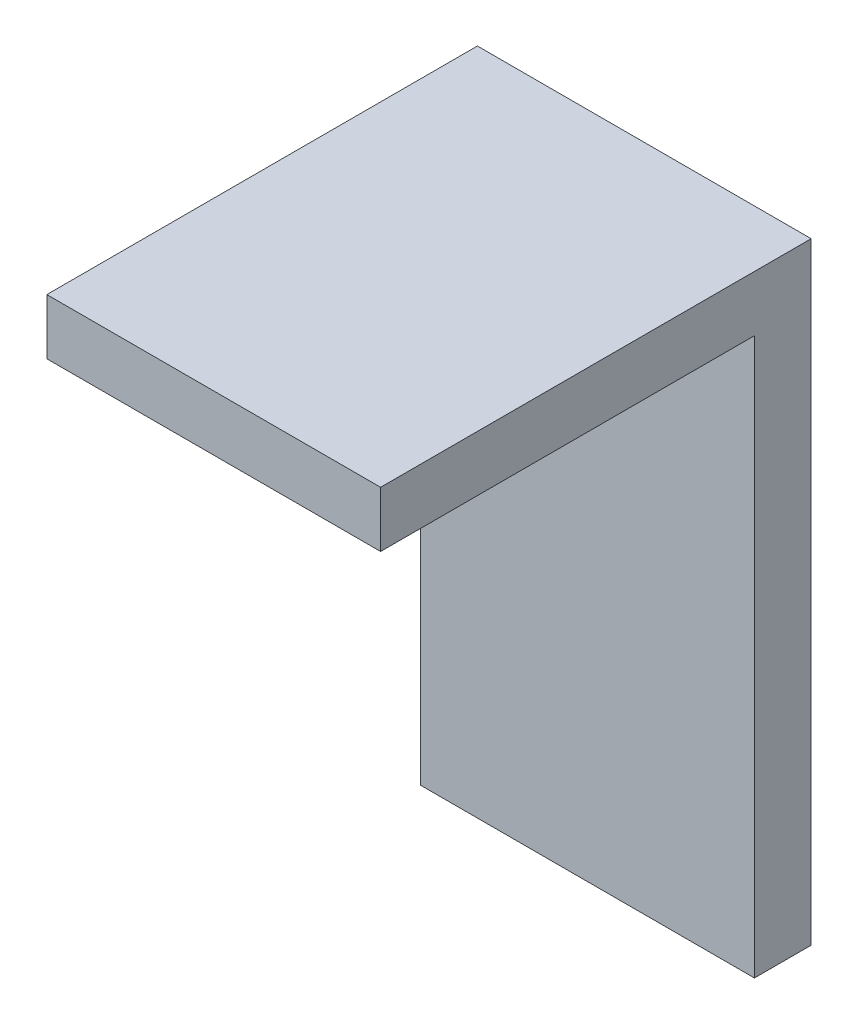
ISO-10303-21;
HEADER;
FILE_DESCRIPTION(('STEP AP214'),'2;1');
FILE_NAME('part.step','',(''),(''),'','','');
FILE_SCHEMA(('AUTOMOTIVE_DESIGN { 1 0 10303 214 1 1 1 1 }'));
ENDSEC;
DATA;
#1=APPLICATION_CONTEXT('core data for automotive mechanical design processes');
#2=APPLICATION_PROTOCOL_DEFINITION('international standard','automotive_design',2000,#1);
#3=PRODUCT_CONTEXT('',#1,'mechanical');
#4=PRODUCT('Part','Part','',(#3));
#5=PRODUCT_RELATED_PRODUCT_CATEGORY('part','',(#4));
#6=PRODUCT_DEFINITION_FORMATION('','',#4);
#7=PRODUCT_DEFINITION_CONTEXT('part definition',#1,'design');
#8=PRODUCT_DEFINITION('design','',#6,#7);
#9=PRODUCT_DEFINITION_SHAPE('','',#8);
#10=(LENGTH_UNIT() NAMED_UNIT(*) SI_UNIT(.MILLI.,.METRE.));
#11=(NAMED_UNIT(*) PLANE_ANGLE_UNIT() SI_UNIT($,.RADIAN.));
#12=(NAMED_UNIT(*) SI_UNIT($,.STERADIAN.) SOLID_ANGLE_UNIT());
#13=UNCERTAINTY_MEASURE_WITH_UNIT(LENGTH_MEASURE(1.E-05),#10,'distance_accuracy_value','');
#14=(GEOMETRIC_REPRESENTATION_CONTEXT(3) GLOBAL_UNCERTAINTY_ASSIGNED_CONTEXT((#13)) GLOBAL_UNIT_ASSIGNED_CONTEXT((#10,
#11,#12)) REPRESENTATION_CONTEXT('',''));
#15=CARTESIAN_POINT('',(0.,0.,0.));
#16=DIRECTION('',(0.,0.,1.));
#17=DIRECTION('',(1.,0.,0.));
#18=AXIS2_PLACEMENT_3D('',#15,#16,#17);
#19=CARTESIAN_POINT('',(-3.9,4.55,0.));
#20=DIRECTION('',(-1.,0.,0.));
#21=DIRECTION('',(0.,0.,1.));
#22=AXIS2_PLACEMENT_3D('',#19,#20,#21);
#23=PLANE('',#22);
#24=DIRECTION('',(0.,1.,0.));
#25=VECTOR('',#24,1.);
#26=CARTESIAN_POINT('',(-3.9,4.,0.));
#27=LINE('',#26,#25);
#28=CARTESIAN_POINT('',(-3.9,4.,0.));
#29=VERTEX_POINT('',#28);
#30=CARTESIAN_POINT('',(-3.9,4.55,0.));
#31=VERTEX_POINT('',#30);
#32=EDGE_CURVE('E11',#29,#31,#27,.T.);
#33=ORIENTED_EDGE('',*,*,#32,.F.);
#34=DIRECTION('',(0.,0.,-1.));
#35=VECTOR('',#34,1.);
#36=CARTESIAN_POINT('',(-3.9,4.,0.051));
#37=LINE('',#36,#35);
#38=CARTESIAN_POINT('',(-3.9,4.,0.051));
#39=VERTEX_POINT('',#38);
#40=EDGE_CURVE('E24',#39,#29,#37,.T.);
#41=ORIENTED_EDGE('',*,*,#40,.F.);
#42=DIRECTION('',(0.,-1.,0.));
#43=VECTOR('',#42,1.);
#44=CARTESIAN_POINT('',(-3.9,4.5,0.051));
#45=LINE('',#44,#43);
#46=CARTESIAN_POINT('',(-3.9,4.5,0.051));
#47=VERTEX_POINT('',#46);
#48=EDGE_CURVE('E87',#47,#39,#45,.T.);
#49=ORIENTED_EDGE('',*,*,#48,.F.);
#50=DIRECTION('',(0.,0.,-1.));
#51=VECTOR('',#50,1.);
#52=CARTESIAN_POINT('',(-3.9,4.5,0.387));
#53=LINE('',#52,#51);
#54=CARTESIAN_POINT('',(-3.9,4.5,0.387));
#55=VERTEX_POINT('',#54);
#56=EDGE_CURVE('E114',#55,#47,#53,.T.);
#57=ORIENTED_EDGE('',*,*,#56,.F.);
#58=DIRECTION('',(0.,-1.,0.));
#59=VECTOR('',#58,1.);
#60=CARTESIAN_POINT('',(-3.9,4.55,0.387));
#61=LINE('',#60,#59);
#62=CARTESIAN_POINT('',(-3.9,4.55,0.387));
#63=VERTEX_POINT('',#62);
#64=EDGE_CURVE('E111',#63,#55,#61,.T.);
#65=ORIENTED_EDGE('',*,*,#64,.F.);
#66=DIRECTION('',(0.,0.,1.));
#67=VECTOR('',#66,1.);
#68=CARTESIAN_POINT('',(-3.9,4.55,0.));
#69=LINE('',#68,#67);
#70=EDGE_CURVE('E108',#31,#63,#69,.T.);
#71=ORIENTED_EDGE('',*,*,#70,.F.);
#72=EDGE_LOOP('',(#33,#41,#49,#57,#65,#71));
#73=FACE_BOUND('',#72,.T.);
#74=ADVANCED_FACE('F17',(#73),#23,.T.);
#75=CARTESIAN_POINT('',(-3.6,4.,0.));
#76=DIRECTION('',(1.,0.,0.));
#77=DIRECTION('',(0.,0.,1.));
#78=AXIS2_PLACEMENT_3D('',#75,#76,#77);
#79=PLANE('',#78);
#80=DIRECTION('',(0.,-1.,0.));
#81=VECTOR('',#80,1.);
#82=CARTESIAN_POINT('',(-3.6,4.55,0.));
#83=LINE('',#82,#81);
#84=CARTESIAN_POINT('',(-3.6,4.55,0.));
#85=VERTEX_POINT('',#84);
#86=CARTESIAN_POINT('',(-3.6,4.,0.));
#87=VERTEX_POINT('',#86);
#88=EDGE_CURVE('E106',#85,#87,#83,.T.);
#89=ORIENTED_EDGE('',*,*,#88,.F.);
#90=DIRECTION('',(0.,0.,-1.));
#91=VECTOR('',#90,1.);
#92=CARTESIAN_POINT('',(-3.6,4.55,0.387));
#93=LINE('',#92,#91);
#94=CARTESIAN_POINT('',(-3.6,4.55,0.387));
#95=VERTEX_POINT('',#94);
#96=EDGE_CURVE('E103',#95,#85,#93,.T.);
#97=ORIENTED_EDGE('',*,*,#96,.F.);
#98=DIRECTION('',(0.,1.,0.));
#99=VECTOR('',#98,1.);
#100=CARTESIAN_POINT('',(-3.6,4.5,0.387));
#101=LINE('',#100,#99);
#102=CARTESIAN_POINT('',(-3.6,4.5,0.387));
#103=VERTEX_POINT('',#102);
#104=EDGE_CURVE('E100',#103,#95,#101,.T.);
#105=ORIENTED_EDGE('',*,*,#104,.F.);
#106=DIRECTION('',(0.,0.,1.));
#107=VECTOR('',#106,1.);
#108=CARTESIAN_POINT('',(-3.6,4.5,0.051));
#109=LINE('',#108,#107);
#110=CARTESIAN_POINT('',(-3.6,4.5,0.051));
#111=VERTEX_POINT('',#110);
#112=EDGE_CURVE('E72',#111,#103,#109,.T.);
#113=ORIENTED_EDGE('',*,*,#112,.F.);
#114=DIRECTION('',(0.,1.,0.));
#115=VECTOR('',#114,1.);
#116=CARTESIAN_POINT('',(-3.6,4.,0.051));
#117=LINE('',#116,#115);
#118=CARTESIAN_POINT('',(-3.6,4.,0.051));
#119=VERTEX_POINT('',#118);
#120=EDGE_CURVE('E66',#119,#111,#117,.T.);
#121=ORIENTED_EDGE('',*,*,#120,.F.);
#122=DIRECTION('',(0.,0.,1.));
#123=VECTOR('',#122,1.);
#124=CARTESIAN_POINT('',(-3.6,4.,0.));
#125=LINE('',#124,#123);
#126=EDGE_CURVE('E69',#87,#119,#125,.T.);
#127=ORIENTED_EDGE('',*,*,#126,.F.);
#128=EDGE_LOOP('',(#89,#97,#105,#113,#121,#127));
#129=FACE_BOUND('',#128,.T.);
#130=ADVANCED_FACE('F68',(#129),#79,.T.);
#131=CARTESIAN_POINT('',(-3.9,4.55,0.387));
#132=DIRECTION('',(0.,0.,1.));
#133=DIRECTION('',(0.,1.,0.));
#134=AXIS2_PLACEMENT_3D('',#131,#132,#133);
#135=PLANE('',#134);
#136=ORIENTED_EDGE('',*,*,#64,.T.);
#137=DIRECTION('',(-1.,0.,0.));
#138=VECTOR('',#137,1.);
#139=CARTESIAN_POINT('',(-3.6,4.5,0.387));
#140=LINE('',#139,#138);
#141=EDGE_CURVE('E83',#103,#55,#140,.T.);
#142=ORIENTED_EDGE('',*,*,#141,.F.);
#143=ORIENTED_EDGE('',*,*,#104,.T.);
#144=DIRECTION('',(1.,0.,0.));
#145=VECTOR('',#144,1.);
#146=CARTESIAN_POINT('',(-3.9,4.55,0.387));
#147=LINE('',#146,#145);
#148=EDGE_CURVE('E88',#63,#95,#147,.T.);
#149=ORIENTED_EDGE('',*,*,#148,.F.);
#150=EDGE_LOOP('',(#136,#142,#143,#149));
#151=FACE_BOUND('',#150,.T.);
#152=ADVANCED_FACE('F125',(#151),#135,.T.);
#153=CARTESIAN_POINT('',(-3.9,4.5,0.051));
#154=DIRECTION('',(0.,0.,1.));
#155=DIRECTION('',(0.,1.,0.));
#156=AXIS2_PLACEMENT_3D('',#153,#154,#155);
#157=PLANE('',#156);
#158=ORIENTED_EDGE('',*,*,#48,.T.);
#159=DIRECTION('',(-1.,0.,0.));
#160=VECTOR('',#159,1.);
#161=CARTESIAN_POINT('',(-3.6,4.,0.051));
#162=LINE('',#161,#160);
#163=EDGE_CURVE('E81',#119,#39,#162,.T.);
#164=ORIENTED_EDGE('',*,*,#163,.F.);
#165=ORIENTED_EDGE('',*,*,#120,.T.);
#166=DIRECTION('',(1.,0.,0.));
#167=VECTOR('',#166,1.);
#168=CARTESIAN_POINT('',(-3.9,4.5,0.051));
#169=LINE('',#168,#167);
#170=EDGE_CURVE('E89',#47,#111,#169,.T.);
#171=ORIENTED_EDGE('',*,*,#170,.F.);
#172=EDGE_LOOP('',(#158,#164,#165,#171));
#173=FACE_BOUND('',#172,.T.);
#174=ADVANCED_FACE('F86',(#173),#157,.T.);
#175=CARTESIAN_POINT('',(-3.6,4.55,0.));
#176=DIRECTION('',(0.,1.,0.));
#177=DIRECTION('',(0.,0.,1.));
#178=AXIS2_PLACEMENT_3D('',#175,#176,#177);
#179=PLANE('',#178);
#180=DIRECTION('',(1.,0.,0.));
#181=VECTOR('',#180,1.);
#182=CARTESIAN_POINT('',(-3.9,4.55,0.));
#183=LINE('',#182,#181);
#184=EDGE_CURVE('E93',#31,#85,#183,.T.);
#185=ORIENTED_EDGE('',*,*,#184,.F.);
#186=ORIENTED_EDGE('',*,*,#70,.T.);
#187=ORIENTED_EDGE('',*,*,#148,.T.);
#188=ORIENTED_EDGE('',*,*,#96,.T.);
#189=EDGE_LOOP('',(#185,#186,#187,#188));
#190=FACE_BOUND('',#189,.T.);
#191=ADVANCED_FACE('F121',(#190),#179,.T.);
#192=CARTESIAN_POINT('',(-3.9,4.,0.));
#193=DIRECTION('',(0.,-1.,0.));
#194=DIRECTION('',(0.,0.,1.));
#195=AXIS2_PLACEMENT_3D('',#192,#193,#194);
#196=PLANE('',#195);
#197=DIRECTION('',(-1.,0.,0.));
#198=VECTOR('',#197,1.);
#199=CARTESIAN_POINT('',(-3.6,4.,0.));
#200=LINE('',#199,#198);
#201=EDGE_CURVE('E82',#87,#29,#200,.T.);
#202=ORIENTED_EDGE('',*,*,#201,.F.);
#203=ORIENTED_EDGE('',*,*,#126,.T.);
#204=ORIENTED_EDGE('',*,*,#163,.T.);
#205=ORIENTED_EDGE('',*,*,#40,.T.);
#206=EDGE_LOOP('',(#202,#203,#204,#205));
#207=FACE_BOUND('',#206,.T.);
#208=ADVANCED_FACE('F80',(#207),#196,.T.);
#209=CARTESIAN_POINT('',(-3.9,4.5,0.051));
#210=DIRECTION('',(0.,-1.,0.));
#211=DIRECTION('',(0.,0.,1.));
#212=AXIS2_PLACEMENT_3D('',#209,#210,#211);
#213=PLANE('',#212);
#214=ORIENTED_EDGE('',*,*,#170,.T.);
#215=ORIENTED_EDGE('',*,*,#112,.T.);
#216=ORIENTED_EDGE('',*,*,#141,.T.);
#217=ORIENTED_EDGE('',*,*,#56,.T.);
#218=EDGE_LOOP('',(#214,#215,#216,#217));
#219=FACE_BOUND('',#218,.T.);
#220=ADVANCED_FACE('F127',(#219),#213,.T.);
#221=CARTESIAN_POINT('',(-3.6,4.55,0.));
#222=DIRECTION('',(0.,0.,-1.));
#223=DIRECTION('',(0.,1.,0.));
#224=AXIS2_PLACEMENT_3D('',#221,#222,#223);
#225=PLANE('',#224);
#226=ORIENTED_EDGE('',*,*,#88,.T.);
#227=ORIENTED_EDGE('',*,*,#201,.T.);
#228=ORIENTED_EDGE('',*,*,#32,.T.);
#229=ORIENTED_EDGE('',*,*,#184,.T.);
#230=EDGE_LOOP('',(#226,#227,#228,#229));
#231=FACE_BOUND('',#230,.T.);
#232=ADVANCED_FACE('F117',(#231),#225,.T.);
#233=CLOSED_SHELL('',(#74,#130,#152,#174,#191,#208,#220,#232));
#234=MANIFOLD_SOLID_BREP('B1',#233);
#235=ADVANCED_BREP_SHAPE_REPRESENTATION('',(#18,#234),#14);
#236=SHAPE_DEFINITION_REPRESENTATION(#9,#235);
ENDSEC;
END-ISO-10303-21;
